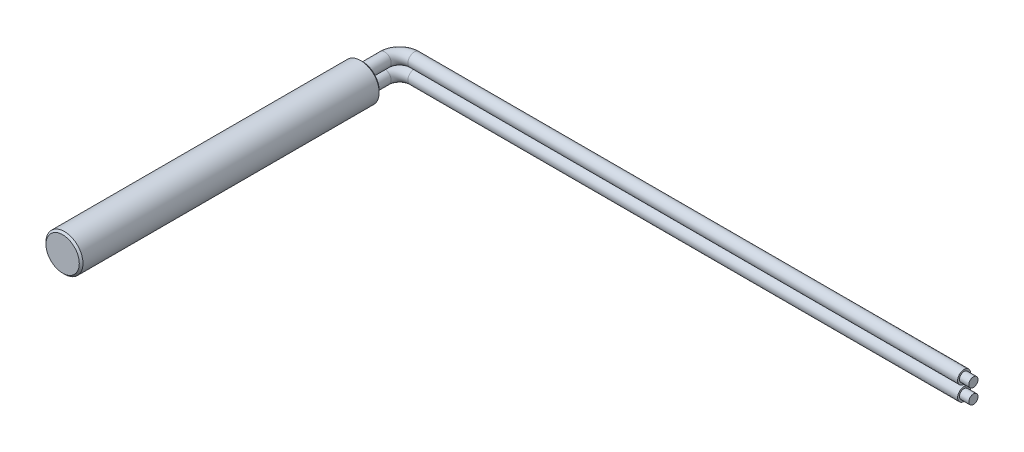
ISO-10303-21;
HEADER;
FILE_DESCRIPTION(('STEP AP214'),'2;1');
FILE_NAME('part.step','',(''),(''),'','','');
FILE_SCHEMA(('AUTOMOTIVE_DESIGN { 1 0 10303 214 1 1 1 1 }'));
ENDSEC;
DATA;
#1=APPLICATION_CONTEXT('core data for automotive mechanical design processes');
#2=APPLICATION_PROTOCOL_DEFINITION('international standard','automotive_design',2000,#1);
#3=PRODUCT_CONTEXT('',#1,'mechanical');
#4=PRODUCT('Part','Part','',(#3));
#5=PRODUCT_RELATED_PRODUCT_CATEGORY('part','',(#4));
#6=PRODUCT_DEFINITION_FORMATION('','',#4);
#7=PRODUCT_DEFINITION_CONTEXT('part definition',#1,'design');
#8=PRODUCT_DEFINITION('design','',#6,#7);
#9=PRODUCT_DEFINITION_SHAPE('','',#8);
#10=(LENGTH_UNIT() NAMED_UNIT(*) SI_UNIT(.MILLI.,.METRE.));
#11=(NAMED_UNIT(*) PLANE_ANGLE_UNIT() SI_UNIT($,.RADIAN.));
#12=(NAMED_UNIT(*) SI_UNIT($,.STERADIAN.) SOLID_ANGLE_UNIT());
#13=UNCERTAINTY_MEASURE_WITH_UNIT(LENGTH_MEASURE(1.E-05),#10,'distance_accuracy_value','');
#14=(GEOMETRIC_REPRESENTATION_CONTEXT(3) GLOBAL_UNCERTAINTY_ASSIGNED_CONTEXT((#13)) GLOBAL_UNIT_ASSIGNED_CONTEXT((#10,
#11,#12)) REPRESENTATION_CONTEXT('',''));
#15=CARTESIAN_POINT('',(0.,0.,0.));
#16=DIRECTION('',(0.,0.,1.));
#17=DIRECTION('',(1.,0.,0.));
#18=AXIS2_PLACEMENT_3D('',#15,#16,#17);
#19=CARTESIAN_POINT('',(0.,0.,16.2));
#20=DIRECTION('',(0.,0.,-1.));
#21=DIRECTION('',(-1.,0.,0.));
#22=AXIS2_PLACEMENT_3D('',#19,#20,#21);
#23=CYLINDRICAL_SURFACE('',#22,1.);
#24=CARTESIAN_POINT('',(0.,0.,0.100000000000003));
#25=DIRECTION('',(0.,0.,1.));
#26=DIRECTION('',(1.,0.,0.));
#27=AXIS2_PLACEMENT_3D('',#24,#25,#26);
#28=CIRCLE('',#27,1.);
#29=CARTESIAN_POINT('',(1.,0.,0.100000000000003));
#30=VERTEX_POINT('',#29);
#31=EDGE_CURVE('E77',#30,#30,#28,.T.);
#32=ORIENTED_EDGE('',*,*,#31,.T.);
#33=EDGE_LOOP('',(#32));
#34=FACE_BOUND('',#33,.T.);
#35=CARTESIAN_POINT('',(0.,0.,16.1));
#36=DIRECTION('',(0.,0.,1.));
#37=DIRECTION('',(1.,0.,0.));
#38=AXIS2_PLACEMENT_3D('',#35,#36,#37);
#39=CIRCLE('',#38,1.);
#40=CARTESIAN_POINT('',(1.,0.,16.1));
#41=VERTEX_POINT('',#40);
#42=EDGE_CURVE('E74',#41,#41,#39,.F.);
#43=ORIENTED_EDGE('',*,*,#42,.T.);
#44=EDGE_LOOP('',(#43));
#45=FACE_BOUND('',#44,.T.);
#46=ADVANCED_FACE('F35',(#34,#45),#23,.T.);
#47=CARTESIAN_POINT('',(0.,0.,16.2));
#48=DIRECTION('',(0.,0.,1.));
#49=DIRECTION('',(1.,0.,0.));
#50=AXIS2_PLACEMENT_3D('',#47,#48,#49);
#51=PLANE('',#50);
#52=CARTESIAN_POINT('',(0.,0.,16.2));
#53=DIRECTION('',(0.,0.,1.));
#54=DIRECTION('',(1.,0.,0.));
#55=AXIS2_PLACEMENT_3D('',#52,#53,#54);
#56=CIRCLE('',#55,0.9);
#57=CARTESIAN_POINT('',(0.9,0.,16.2));
#58=VERTEX_POINT('',#57);
#59=EDGE_CURVE('E39',#58,#58,#56,.T.);
#60=ORIENTED_EDGE('',*,*,#59,.T.);
#61=EDGE_LOOP('',(#60));
#62=FACE_BOUND('',#61,.T.);
#63=ADVANCED_FACE('F110',(#62),#51,.T.);
#64=CARTESIAN_POINT('',(0.,0.,0.));
#65=DIRECTION('',(0.,0.,1.));
#66=DIRECTION('',(1.,0.,0.));
#67=AXIS2_PLACEMENT_3D('',#64,#65,#66);
#68=PLANE('',#67);
#69=CARTESIAN_POINT('',(0.,0.4,0.));
#70=DIRECTION('',(0.,0.,-1.));
#71=DIRECTION('',(-1.,0.,0.));
#72=AXIS2_PLACEMENT_3D('',#69,#70,#71);
#73=CIRCLE('',#72,0.35);
#74=CARTESIAN_POINT('',(-0.35,0.4,0.));
#75=VERTEX_POINT('',#74);
#76=EDGE_CURVE('E93',#75,#75,#73,.T.);
#77=ORIENTED_EDGE('',*,*,#76,.F.);
#78=EDGE_LOOP('',(#77));
#79=FACE_BOUND('',#78,.T.);
#80=CARTESIAN_POINT('',(0.,-0.4,0.));
#81=DIRECTION('',(0.,0.,-1.));
#82=DIRECTION('',(-1.,0.,0.));
#83=AXIS2_PLACEMENT_3D('',#80,#81,#82);
#84=CIRCLE('',#83,0.35);
#85=CARTESIAN_POINT('',(-0.35,-0.4,0.));
#86=VERTEX_POINT('',#85);
#87=EDGE_CURVE('E57',#86,#86,#84,.T.);
#88=ORIENTED_EDGE('',*,*,#87,.F.);
#89=EDGE_LOOP('',(#88));
#90=FACE_BOUND('',#89,.T.);
#91=CARTESIAN_POINT('',(0.,0.,0.));
#92=DIRECTION('',(0.,0.,1.));
#93=DIRECTION('',(1.,0.,0.));
#94=AXIS2_PLACEMENT_3D('',#91,#92,#93);
#95=CIRCLE('',#94,0.899999999999998);
#96=CARTESIAN_POINT('',(0.899999999999998,0.,0.));
#97=VERTEX_POINT('',#96);
#98=EDGE_CURVE('E79',#97,#97,#95,.F.);
#99=ORIENTED_EDGE('',*,*,#98,.T.);
#100=EDGE_LOOP('',(#99));
#101=FACE_BOUND('',#100,.T.);
#102=ADVANCED_FACE('F106',(#79,#90,#101),#68,.F.);
#103=CARTESIAN_POINT('',(0.,0.,0.100000000000003));
#104=DIRECTION('',(0.,0.,1.));
#105=DIRECTION('',(1.,0.,0.));
#106=AXIS2_PLACEMENT_3D('',#103,#104,#105);
#107=CONICAL_SURFACE('',#106,1.,0.785398163397444);
#108=ORIENTED_EDGE('',*,*,#98,.F.);
#109=EDGE_LOOP('',(#108));
#110=FACE_BOUND('',#109,.T.);
#111=ORIENTED_EDGE('',*,*,#31,.F.);
#112=EDGE_LOOP('',(#111));
#113=FACE_BOUND('',#112,.T.);
#114=ADVANCED_FACE('F109',(#110,#113),#107,.T.);
#115=CARTESIAN_POINT('',(0.,0.,16.2));
#116=DIRECTION('',(0.,0.,-1.));
#117=DIRECTION('',(-1.,0.,0.));
#118=AXIS2_PLACEMENT_3D('',#115,#116,#117);
#119=CONICAL_SURFACE('',#118,0.9,0.785398163397453);
#120=ORIENTED_EDGE('',*,*,#42,.F.);
#121=EDGE_LOOP('',(#120));
#122=FACE_BOUND('',#121,.T.);
#123=ORIENTED_EDGE('',*,*,#59,.F.);
#124=EDGE_LOOP('',(#123));
#125=FACE_BOUND('',#124,.T.);
#126=ADVANCED_FACE('F37',(#122,#125),#119,.T.);
#127=CARTESIAN_POINT('',(30.5,-0.4,-2.));
#128=DIRECTION('',(1.,0.,0.));
#129=DIRECTION('',(0.,0.,-1.));
#130=AXIS2_PLACEMENT_3D('',#127,#128,#129);
#131=PLANE('',#130);
#132=CARTESIAN_POINT('',(30.5,-0.4,-2.));
#133=DIRECTION('',(1.,0.,0.));
#134=DIRECTION('',(0.,0.,-1.));
#135=AXIS2_PLACEMENT_3D('',#132,#133,#134);
#136=CIRCLE('',#135,0.25);
#137=CARTESIAN_POINT('',(30.5,-0.4,-2.25));
#138=VERTEX_POINT('',#137);
#139=EDGE_CURVE('E11',#138,#138,#136,.T.);
#140=ORIENTED_EDGE('',*,*,#139,.F.);
#141=EDGE_LOOP('',(#140));
#142=FACE_BOUND('',#141,.T.);
#143=CARTESIAN_POINT('',(30.5,-0.4,-2.));
#144=DIRECTION('',(1.,0.,0.));
#145=DIRECTION('',(0.,0.,-1.));
#146=AXIS2_PLACEMENT_3D('',#143,#144,#145);
#147=CIRCLE('',#146,0.35);
#148=CARTESIAN_POINT('',(30.5,-0.4,-2.35));
#149=VERTEX_POINT('',#148);
#150=EDGE_CURVE('E50',#149,#149,#147,.T.);
#151=ORIENTED_EDGE('',*,*,#150,.T.);
#152=EDGE_LOOP('',(#151));
#153=FACE_BOUND('',#152,.T.);
#154=ADVANCED_FACE('F117',(#142,#153),#131,.T.);
#155=CARTESIAN_POINT('',(0.,-0.4,0.));
#156=DIRECTION('',(0.,0.,-1.));
#157=DIRECTION('',(-1.,0.,0.));
#158=AXIS2_PLACEMENT_3D('',#155,#156,#157);
#159=CYLINDRICAL_SURFACE('',#158,0.35);
#160=CARTESIAN_POINT('',(0.,-0.4,-1.2));
#161=DIRECTION('',(0.,0.,-1.));
#162=DIRECTION('',(-1.,0.,0.));
#163=AXIS2_PLACEMENT_3D('',#160,#161,#162);
#164=CIRCLE('',#163,0.35);
#165=CARTESIAN_POINT('',(-0.35,-0.4,-1.2));
#166=VERTEX_POINT('',#165);
#167=EDGE_CURVE('E61',#166,#166,#164,.T.);
#168=ORIENTED_EDGE('',*,*,#167,.F.);
#169=EDGE_LOOP('',(#168));
#170=FACE_BOUND('',#169,.T.);
#171=ORIENTED_EDGE('',*,*,#87,.T.);
#172=EDGE_LOOP('',(#171));
#173=FACE_BOUND('',#172,.T.);
#174=ADVANCED_FACE('F114',(#170,#173),#159,.T.);
#175=CARTESIAN_POINT('',(0.8,-0.4,-1.2));
#176=DIRECTION('',(0.,-1.,0.));
#177=DIRECTION('',(0.,0.,-1.));
#178=AXIS2_PLACEMENT_3D('',#175,#176,#177);
#179=TOROIDAL_SURFACE('',#178,0.8,0.35);
#180=CARTESIAN_POINT('',(0.8,-0.4,-2.));
#181=DIRECTION('',(1.,0.,0.));
#182=DIRECTION('',(0.,0.,-1.));
#183=AXIS2_PLACEMENT_3D('',#180,#181,#182);
#184=CIRCLE('',#183,0.35);
#185=CARTESIAN_POINT('',(0.8,-0.4,-2.35));
#186=VERTEX_POINT('',#185);
#187=EDGE_CURVE('E70',#186,#186,#184,.T.);
#188=CARTESIAN_POINT('',(0.8,-0.4,-1.2));
#189=DIRECTION('',(0.,-1.,0.));
#190=DIRECTION('',(0.,0.,-1.));
#191=AXIS2_PLACEMENT_3D('',#188,#189,#190);
#192=CIRCLE('',#191,1.15);
#193=EDGE_CURVE('',#166,#186,#192,.T.);
#194=ORIENTED_EDGE('',*,*,#167,.T.);
#195=ORIENTED_EDGE('',*,*,#187,.F.);
#196=ORIENTED_EDGE('',*,*,#193,.T.);
#197=ORIENTED_EDGE('',*,*,#193,.F.);
#198=EDGE_LOOP('',(#194,#196,#195,#197));
#199=FACE_BOUND('',#198,.T.);
#200=ADVANCED_FACE('F116',(#199),#179,.T.);
#201=CARTESIAN_POINT('',(0.8,-0.4,-2.));
#202=DIRECTION('',(1.,0.,0.));
#203=DIRECTION('',(0.,0.,-1.));
#204=AXIS2_PLACEMENT_3D('',#201,#202,#203);
#205=CYLINDRICAL_SURFACE('',#204,0.35);
#206=ORIENTED_EDGE('',*,*,#150,.F.);
#207=EDGE_LOOP('',(#206));
#208=FACE_BOUND('',#207,.T.);
#209=ORIENTED_EDGE('',*,*,#187,.T.);
#210=EDGE_LOOP('',(#209));
#211=FACE_BOUND('',#210,.T.);
#212=ADVANCED_FACE('F124',(#208,#211),#205,.T.);
#213=CARTESIAN_POINT('',(30.5,0.4,-2.));
#214=DIRECTION('',(1.,0.,0.));
#215=DIRECTION('',(0.,0.,-1.));
#216=AXIS2_PLACEMENT_3D('',#213,#214,#215);
#217=PLANE('',#216);
#218=CARTESIAN_POINT('',(30.5,0.4,-2.));
#219=DIRECTION('',(1.,0.,0.));
#220=DIRECTION('',(0.,0.,-1.));
#221=AXIS2_PLACEMENT_3D('',#218,#219,#220);
#222=CIRCLE('',#221,0.25);
#223=CARTESIAN_POINT('',(30.5,0.4,-2.25));
#224=VERTEX_POINT('',#223);
#225=EDGE_CURVE('E44',#224,#224,#222,.T.);
#226=ORIENTED_EDGE('',*,*,#225,.F.);
#227=EDGE_LOOP('',(#226));
#228=FACE_BOUND('',#227,.T.);
#229=CARTESIAN_POINT('',(30.5,0.4,-2.));
#230=DIRECTION('',(1.,0.,0.));
#231=DIRECTION('',(0.,0.,-1.));
#232=AXIS2_PLACEMENT_3D('',#229,#230,#231);
#233=CIRCLE('',#232,0.35);
#234=CARTESIAN_POINT('',(30.5,0.4,-2.35));
#235=VERTEX_POINT('',#234);
#236=EDGE_CURVE('E54',#235,#235,#233,.T.);
#237=ORIENTED_EDGE('',*,*,#236,.T.);
#238=EDGE_LOOP('',(#237));
#239=FACE_BOUND('',#238,.T.);
#240=ADVANCED_FACE('F55',(#228,#239),#217,.T.);
#241=CARTESIAN_POINT('',(0.,0.4,0.));
#242=DIRECTION('',(0.,0.,-1.));
#243=DIRECTION('',(-1.,0.,0.));
#244=AXIS2_PLACEMENT_3D('',#241,#242,#243);
#245=CYLINDRICAL_SURFACE('',#244,0.35);
#246=CARTESIAN_POINT('',(0.,0.4,-1.2));
#247=DIRECTION('',(0.,0.,-1.));
#248=DIRECTION('',(-1.,0.,0.));
#249=AXIS2_PLACEMENT_3D('',#246,#247,#248);
#250=CIRCLE('',#249,0.35);
#251=CARTESIAN_POINT('',(-0.35,0.4,-1.2));
#252=VERTEX_POINT('',#251);
#253=EDGE_CURVE('E64',#252,#252,#250,.T.);
#254=ORIENTED_EDGE('',*,*,#253,.F.);
#255=EDGE_LOOP('',(#254));
#256=FACE_BOUND('',#255,.T.);
#257=ORIENTED_EDGE('',*,*,#76,.T.);
#258=EDGE_LOOP('',(#257));
#259=FACE_BOUND('',#258,.T.);
#260=ADVANCED_FACE('F100',(#256,#259),#245,.T.);
#261=CARTESIAN_POINT('',(0.8,0.4,-1.2));
#262=DIRECTION('',(0.,-1.,0.));
#263=DIRECTION('',(0.,0.,-1.));
#264=AXIS2_PLACEMENT_3D('',#261,#262,#263);
#265=TOROIDAL_SURFACE('',#264,0.8,0.35);
#266=CARTESIAN_POINT('',(0.8,0.4,-2.));
#267=DIRECTION('',(1.,0.,0.));
#268=DIRECTION('',(0.,0.,-1.));
#269=AXIS2_PLACEMENT_3D('',#266,#267,#268);
#270=CIRCLE('',#269,0.35);
#271=CARTESIAN_POINT('',(0.8,0.4,-2.35));
#272=VERTEX_POINT('',#271);
#273=EDGE_CURVE('E58',#272,#272,#270,.T.);
#274=CARTESIAN_POINT('',(0.8,0.4,-1.2));
#275=DIRECTION('',(0.,-1.,0.));
#276=DIRECTION('',(0.,0.,-1.));
#277=AXIS2_PLACEMENT_3D('',#274,#275,#276);
#278=CIRCLE('',#277,1.15);
#279=EDGE_CURVE('',#252,#272,#278,.T.);
#280=ORIENTED_EDGE('',*,*,#253,.T.);
#281=ORIENTED_EDGE('',*,*,#273,.F.);
#282=ORIENTED_EDGE('',*,*,#279,.T.);
#283=ORIENTED_EDGE('',*,*,#279,.F.);
#284=EDGE_LOOP('',(#280,#282,#281,#283));
#285=FACE_BOUND('',#284,.T.);
#286=ADVANCED_FACE('F98',(#285),#265,.T.);
#287=CARTESIAN_POINT('',(0.8,0.4,-2.));
#288=DIRECTION('',(1.,0.,0.));
#289=DIRECTION('',(0.,0.,-1.));
#290=AXIS2_PLACEMENT_3D('',#287,#288,#289);
#291=CYLINDRICAL_SURFACE('',#290,0.35);
#292=ORIENTED_EDGE('',*,*,#236,.F.);
#293=EDGE_LOOP('',(#292));
#294=FACE_BOUND('',#293,.T.);
#295=ORIENTED_EDGE('',*,*,#273,.T.);
#296=EDGE_LOOP('',(#295));
#297=FACE_BOUND('',#296,.T.);
#298=ADVANCED_FACE('F129',(#294,#297),#291,.T.);
#299=CARTESIAN_POINT('',(31.,0.4,-2.));
#300=DIRECTION('',(-1.,0.,0.));
#301=DIRECTION('',(0.,0.,1.));
#302=AXIS2_PLACEMENT_3D('',#299,#300,#301);
#303=CYLINDRICAL_SURFACE('',#302,0.25);
#304=CARTESIAN_POINT('',(31.,0.4,-2.));
#305=DIRECTION('',(1.,0.,0.));
#306=DIRECTION('',(0.,0.,-1.));
#307=AXIS2_PLACEMENT_3D('',#304,#305,#306);
#308=CIRCLE('',#307,0.25);
#309=CARTESIAN_POINT('',(31.,0.4,-2.25));
#310=VERTEX_POINT('',#309);
#311=EDGE_CURVE('E92',#310,#310,#308,.T.);
#312=ORIENTED_EDGE('',*,*,#311,.F.);
#313=EDGE_LOOP('',(#312));
#314=FACE_BOUND('',#313,.T.);
#315=ORIENTED_EDGE('',*,*,#225,.T.);
#316=EDGE_LOOP('',(#315));
#317=FACE_BOUND('',#316,.T.);
#318=ADVANCED_FACE('F159',(#314,#317),#303,.T.);
#319=CARTESIAN_POINT('',(31.,0.4,-2.));
#320=DIRECTION('',(1.,0.,0.));
#321=DIRECTION('',(0.,0.,-1.));
#322=AXIS2_PLACEMENT_3D('',#319,#320,#321);
#323=PLANE('',#322);
#324=ORIENTED_EDGE('',*,*,#311,.T.);
#325=EDGE_LOOP('',(#324));
#326=FACE_BOUND('',#325,.T.);
#327=ADVANCED_FACE('F167',(#326),#323,.T.);
#328=CARTESIAN_POINT('',(31.,-0.4,-2.));
#329=DIRECTION('',(-1.,0.,0.));
#330=DIRECTION('',(0.,0.,1.));
#331=AXIS2_PLACEMENT_3D('',#328,#329,#330);
#332=CYLINDRICAL_SURFACE('',#331,0.25);
#333=CARTESIAN_POINT('',(31.,-0.4,-2.));
#334=DIRECTION('',(1.,0.,0.));
#335=DIRECTION('',(0.,0.,-1.));
#336=AXIS2_PLACEMENT_3D('',#333,#334,#335);
#337=CIRCLE('',#336,0.25);
#338=CARTESIAN_POINT('',(31.,-0.4,-2.25));
#339=VERTEX_POINT('',#338);
#340=EDGE_CURVE('E240',#339,#339,#337,.T.);
#341=ORIENTED_EDGE('',*,*,#340,.F.);
#342=EDGE_LOOP('',(#341));
#343=FACE_BOUND('',#342,.T.);
#344=ORIENTED_EDGE('',*,*,#139,.T.);
#345=EDGE_LOOP('',(#344));
#346=FACE_BOUND('',#345,.T.);
#347=ADVANCED_FACE('F174',(#343,#346),#332,.T.);
#348=CARTESIAN_POINT('',(31.,-0.4,-2.));
#349=DIRECTION('',(1.,0.,0.));
#350=DIRECTION('',(0.,0.,-1.));
#351=AXIS2_PLACEMENT_3D('',#348,#349,#350);
#352=PLANE('',#351);
#353=ORIENTED_EDGE('',*,*,#340,.T.);
#354=EDGE_LOOP('',(#353));
#355=FACE_BOUND('',#354,.T.);
#356=ADVANCED_FACE('F225',(#355),#352,.T.);
#357=CLOSED_SHELL('',(#46,#63,#102,#114,#126,#154,#174,#200,#212,#240,#260,#286,#298,#318,#327,
#347,#356));
#358=MANIFOLD_SOLID_BREP('B2',#357);
#359=ADVANCED_BREP_SHAPE_REPRESENTATION('',(#18,#358),#14);
#360=SHAPE_DEFINITION_REPRESENTATION(#9,#359);
ENDSEC;
END-ISO-10303-21;
